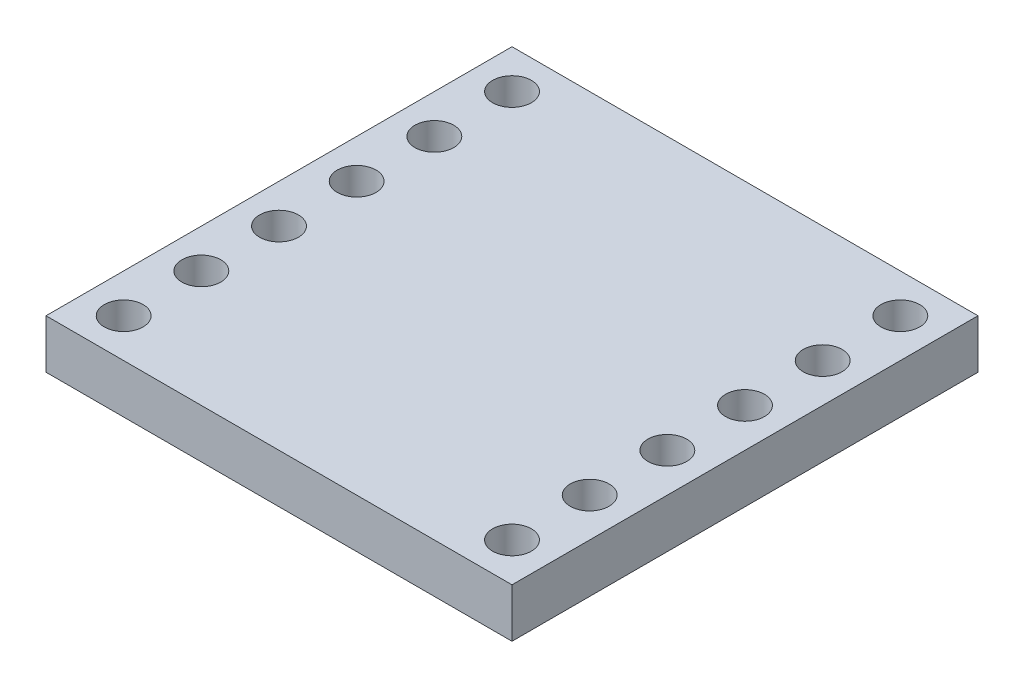
ISO-10303-21;
HEADER;
FILE_DESCRIPTION(('STEP AP214'),'2;1');
FILE_NAME('part.step','',(''),(''),'','','');
FILE_SCHEMA(('AUTOMOTIVE_DESIGN { 1 0 10303 214 1 1 1 1 }'));
ENDSEC;
DATA;
#1=APPLICATION_CONTEXT('core data for automotive mechanical design processes');
#2=APPLICATION_PROTOCOL_DEFINITION('international standard','automotive_design',2000,#1);
#3=PRODUCT_CONTEXT('',#1,'mechanical');
#4=PRODUCT('Part','Part','',(#3));
#5=PRODUCT_RELATED_PRODUCT_CATEGORY('part','',(#4));
#6=PRODUCT_DEFINITION_FORMATION('','',#4);
#7=PRODUCT_DEFINITION_CONTEXT('part definition',#1,'design');
#8=PRODUCT_DEFINITION('design','',#6,#7);
#9=PRODUCT_DEFINITION_SHAPE('','',#8);
#10=(LENGTH_UNIT() NAMED_UNIT(*) SI_UNIT(.MILLI.,.METRE.));
#11=(NAMED_UNIT(*) PLANE_ANGLE_UNIT() SI_UNIT($,.RADIAN.));
#12=(NAMED_UNIT(*) SI_UNIT($,.STERADIAN.) SOLID_ANGLE_UNIT());
#13=UNCERTAINTY_MEASURE_WITH_UNIT(LENGTH_MEASURE(1.E-05),#10,'distance_accuracy_value','');
#14=(GEOMETRIC_REPRESENTATION_CONTEXT(3) GLOBAL_UNCERTAINTY_ASSIGNED_CONTEXT((#13)) GLOBAL_UNIT_ASSIGNED_CONTEXT((#10,
#11,#12)) REPRESENTATION_CONTEXT('',''));
#15=CARTESIAN_POINT('',(0.,0.,0.));
#16=DIRECTION('',(0.,0.,1.));
#17=DIRECTION('',(1.,0.,0.));
#18=AXIS2_PLACEMENT_3D('',#15,#16,#17);
#19=CARTESIAN_POINT('',(0.,1.6,0.));
#20=DIRECTION('',(0.,-1.,0.));
#21=DIRECTION('',(0.,0.,-1.));
#22=AXIS2_PLACEMENT_3D('',#19,#20,#21);
#23=PLANE('',#22);
#24=DIRECTION('',(1.,0.,0.));
#25=VECTOR('',#24,1.);
#26=CARTESIAN_POINT('',(-7.62,1.6,7.62));
#27=LINE('',#26,#25);
#28=CARTESIAN_POINT('',(-7.62,1.6,7.62));
#29=VERTEX_POINT('',#28);
#30=CARTESIAN_POINT('',(7.62000000000001,1.6,7.61999999999999));
#31=VERTEX_POINT('',#30);
#32=EDGE_CURVE('E165',#29,#31,#27,.T.);
#33=ORIENTED_EDGE('',*,*,#32,.T.);
#34=DIRECTION('',(0.,0.,1.));
#35=VECTOR('',#34,1.);
#36=CARTESIAN_POINT('',(7.62,1.6,0.));
#37=LINE('',#36,#35);
#38=CARTESIAN_POINT('',(7.62,1.6,-7.62));
#39=VERTEX_POINT('',#38);
#40=EDGE_CURVE('E100',#39,#31,#37,.T.);
#41=ORIENTED_EDGE('',*,*,#40,.F.);
#42=DIRECTION('',(-1.,0.,0.));
#43=VECTOR('',#42,1.);
#44=CARTESIAN_POINT('',(0.,1.6,-7.62));
#45=LINE('',#44,#43);
#46=CARTESIAN_POINT('',(-7.62,1.6,-7.62));
#47=VERTEX_POINT('',#46);
#48=EDGE_CURVE('E76',#39,#47,#45,.T.);
#49=ORIENTED_EDGE('',*,*,#48,.T.);
#50=DIRECTION('',(0.,0.,1.));
#51=VECTOR('',#50,1.);
#52=CARTESIAN_POINT('',(-7.62,1.6,-7.62));
#53=LINE('',#52,#51);
#54=EDGE_CURVE('E57',#47,#29,#53,.T.);
#55=ORIENTED_EDGE('',*,*,#54,.T.);
#56=EDGE_LOOP('',(#33,#41,#49,#55));
#57=FACE_BOUND('',#56,.T.);
#58=CARTESIAN_POINT('',(-6.35,1.6,-6.35));
#59=DIRECTION('',(0.,1.,0.));
#60=DIRECTION('',(0.,0.,1.));
#61=AXIS2_PLACEMENT_3D('',#58,#59,#60);
#62=CIRCLE('',#61,0.635000000000001);
#63=CARTESIAN_POINT('',(-6.35,1.6,-5.715));
#64=VERTEX_POINT('',#63);
#65=EDGE_CURVE('E158',#64,#64,#62,.T.);
#66=ORIENTED_EDGE('',*,*,#65,.F.);
#67=EDGE_LOOP('',(#66));
#68=FACE_BOUND('',#67,.T.);
#69=CARTESIAN_POINT('',(-6.35,1.6,-3.81));
#70=DIRECTION('',(0.,1.,0.));
#71=DIRECTION('',(0.,0.,1.));
#72=AXIS2_PLACEMENT_3D('',#69,#70,#71);
#73=CIRCLE('',#72,0.635);
#74=CARTESIAN_POINT('',(-6.35,1.6,-3.175));
#75=VERTEX_POINT('',#74);
#76=EDGE_CURVE('E150',#75,#75,#73,.T.);
#77=ORIENTED_EDGE('',*,*,#76,.F.);
#78=EDGE_LOOP('',(#77));
#79=FACE_BOUND('',#78,.T.);
#80=CARTESIAN_POINT('',(-6.35,1.6,-1.27));
#81=DIRECTION('',(0.,1.,0.));
#82=DIRECTION('',(0.,0.,1.));
#83=AXIS2_PLACEMENT_3D('',#80,#81,#82);
#84=CIRCLE('',#83,0.635000000000001);
#85=CARTESIAN_POINT('',(-6.35,1.6,-0.634999999999999));
#86=VERTEX_POINT('',#85);
#87=EDGE_CURVE('E142',#86,#86,#84,.T.);
#88=ORIENTED_EDGE('',*,*,#87,.F.);
#89=EDGE_LOOP('',(#88));
#90=FACE_BOUND('',#89,.T.);
#91=CARTESIAN_POINT('',(-6.35,1.6,1.27));
#92=DIRECTION('',(0.,1.,0.));
#93=DIRECTION('',(0.,0.,1.));
#94=AXIS2_PLACEMENT_3D('',#91,#92,#93);
#95=CIRCLE('',#94,0.635000000000001);
#96=CARTESIAN_POINT('',(-6.35,1.6,1.905));
#97=VERTEX_POINT('',#96);
#98=EDGE_CURVE('E134',#97,#97,#95,.T.);
#99=ORIENTED_EDGE('',*,*,#98,.F.);
#100=EDGE_LOOP('',(#99));
#101=FACE_BOUND('',#100,.T.);
#102=CARTESIAN_POINT('',(-6.35,1.6,3.81));
#103=DIRECTION('',(0.,1.,0.));
#104=DIRECTION('',(0.,0.,1.));
#105=AXIS2_PLACEMENT_3D('',#102,#103,#104);
#106=CIRCLE('',#105,0.635);
#107=CARTESIAN_POINT('',(-6.35,1.6,4.445));
#108=VERTEX_POINT('',#107);
#109=EDGE_CURVE('E126',#108,#108,#106,.T.);
#110=ORIENTED_EDGE('',*,*,#109,.F.);
#111=EDGE_LOOP('',(#110));
#112=FACE_BOUND('',#111,.T.);
#113=CARTESIAN_POINT('',(-6.35,1.6,6.35));
#114=DIRECTION('',(0.,1.,0.));
#115=DIRECTION('',(0.,0.,1.));
#116=AXIS2_PLACEMENT_3D('',#113,#114,#115);
#117=CIRCLE('',#116,0.635);
#118=CARTESIAN_POINT('',(-6.35,1.6,6.985));
#119=VERTEX_POINT('',#118);
#120=EDGE_CURVE('E118',#119,#119,#117,.T.);
#121=ORIENTED_EDGE('',*,*,#120,.F.);
#122=EDGE_LOOP('',(#121));
#123=FACE_BOUND('',#122,.T.);
#124=CARTESIAN_POINT('',(6.35,1.6,6.35));
#125=DIRECTION('',(0.,-1.,0.));
#126=DIRECTION('',(0.,0.,1.));
#127=AXIS2_PLACEMENT_3D('',#124,#125,#126);
#128=CIRCLE('',#127,0.635);
#129=CARTESIAN_POINT('',(6.35,1.6,6.985));
#130=VERTEX_POINT('',#129);
#131=EDGE_CURVE('E249',#130,#130,#128,.T.);
#132=ORIENTED_EDGE('',*,*,#131,.T.);
#133=EDGE_LOOP('',(#132));
#134=FACE_BOUND('',#133,.T.);
#135=CARTESIAN_POINT('',(6.35,1.6,3.81));
#136=DIRECTION('',(0.,-1.,0.));
#137=DIRECTION('',(0.,0.,1.));
#138=AXIS2_PLACEMENT_3D('',#135,#136,#137);
#139=CIRCLE('',#138,0.635);
#140=CARTESIAN_POINT('',(6.35,1.6,4.445));
#141=VERTEX_POINT('',#140);
#142=EDGE_CURVE('E260',#141,#141,#139,.T.);
#143=ORIENTED_EDGE('',*,*,#142,.T.);
#144=EDGE_LOOP('',(#143));
#145=FACE_BOUND('',#144,.T.);
#146=CARTESIAN_POINT('',(6.35,1.6,1.27));
#147=DIRECTION('',(0.,-1.,0.));
#148=DIRECTION('',(0.,0.,1.));
#149=AXIS2_PLACEMENT_3D('',#146,#147,#148);
#150=CIRCLE('',#149,0.635000000000001);
#151=CARTESIAN_POINT('',(6.35,1.6,1.905));
#152=VERTEX_POINT('',#151);
#153=EDGE_CURVE('E268',#152,#152,#150,.T.);
#154=ORIENTED_EDGE('',*,*,#153,.T.);
#155=EDGE_LOOP('',(#154));
#156=FACE_BOUND('',#155,.T.);
#157=CARTESIAN_POINT('',(6.35,1.6,-1.27));
#158=DIRECTION('',(0.,-1.,0.));
#159=DIRECTION('',(0.,0.,1.));
#160=AXIS2_PLACEMENT_3D('',#157,#158,#159);
#161=CIRCLE('',#160,0.635000000000001);
#162=CARTESIAN_POINT('',(6.35,1.6,-0.635000000000003));
#163=VERTEX_POINT('',#162);
#164=EDGE_CURVE('E276',#163,#163,#161,.T.);
#165=ORIENTED_EDGE('',*,*,#164,.T.);
#166=EDGE_LOOP('',(#165));
#167=FACE_BOUND('',#166,.T.);
#168=CARTESIAN_POINT('',(6.35,1.6,-3.81));
#169=DIRECTION('',(0.,-1.,0.));
#170=DIRECTION('',(0.,0.,1.));
#171=AXIS2_PLACEMENT_3D('',#168,#169,#170);
#172=CIRCLE('',#171,0.635);
#173=CARTESIAN_POINT('',(6.35,1.6,-3.175));
#174=VERTEX_POINT('',#173);
#175=EDGE_CURVE('E284',#174,#174,#172,.T.);
#176=ORIENTED_EDGE('',*,*,#175,.T.);
#177=EDGE_LOOP('',(#176));
#178=FACE_BOUND('',#177,.T.);
#179=CARTESIAN_POINT('',(6.35,1.6,-6.35));
#180=DIRECTION('',(0.,-1.,0.));
#181=DIRECTION('',(0.,0.,1.));
#182=AXIS2_PLACEMENT_3D('',#179,#180,#181);
#183=CIRCLE('',#182,0.635000000000001);
#184=CARTESIAN_POINT('',(6.35,1.6,-5.715));
#185=VERTEX_POINT('',#184);
#186=EDGE_CURVE('E105',#185,#185,#183,.T.);
#187=ORIENTED_EDGE('',*,*,#186,.T.);
#188=EDGE_LOOP('',(#187));
#189=FACE_BOUND('',#188,.T.);
#190=ADVANCED_FACE('F39',(#57,#68,#79,#90,#101,#112,#123,#134,#145,#156,#167,#178,#189),#23,.F.);
#191=CARTESIAN_POINT('',(0.,0.,0.));
#192=DIRECTION('',(0.,-1.,0.));
#193=DIRECTION('',(0.,0.,-1.));
#194=AXIS2_PLACEMENT_3D('',#191,#192,#193);
#195=PLANE('',#194);
#196=CARTESIAN_POINT('',(-6.35,0.,3.81));
#197=DIRECTION('',(0.,1.,0.));
#198=DIRECTION('',(0.,0.,1.));
#199=AXIS2_PLACEMENT_3D('',#196,#197,#198);
#200=CIRCLE('',#199,0.635);
#201=CARTESIAN_POINT('',(-6.35,0.,4.445));
#202=VERTEX_POINT('',#201);
#203=EDGE_CURVE('E122',#202,#202,#200,.T.);
#204=ORIENTED_EDGE('',*,*,#203,.T.);
#205=EDGE_LOOP('',(#204));
#206=FACE_BOUND('',#205,.T.);
#207=CARTESIAN_POINT('',(-6.35,0.,-1.27));
#208=DIRECTION('',(0.,1.,0.));
#209=DIRECTION('',(0.,0.,1.));
#210=AXIS2_PLACEMENT_3D('',#207,#208,#209);
#211=CIRCLE('',#210,0.635000000000001);
#212=CARTESIAN_POINT('',(-6.35,0.,-0.634999999999999));
#213=VERTEX_POINT('',#212);
#214=EDGE_CURVE('E138',#213,#213,#211,.T.);
#215=ORIENTED_EDGE('',*,*,#214,.T.);
#216=EDGE_LOOP('',(#215));
#217=FACE_BOUND('',#216,.T.);
#218=CARTESIAN_POINT('',(-6.35,0.,-6.35));
#219=DIRECTION('',(0.,1.,0.));
#220=DIRECTION('',(0.,0.,1.));
#221=AXIS2_PLACEMENT_3D('',#218,#219,#220);
#222=CIRCLE('',#221,0.635000000000001);
#223=CARTESIAN_POINT('',(-6.35,0.,-5.715));
#224=VERTEX_POINT('',#223);
#225=EDGE_CURVE('E154',#224,#224,#222,.T.);
#226=ORIENTED_EDGE('',*,*,#225,.T.);
#227=EDGE_LOOP('',(#226));
#228=FACE_BOUND('',#227,.T.);
#229=DIRECTION('',(1.,0.,0.));
#230=VECTOR('',#229,1.);
#231=CARTESIAN_POINT('',(-7.62,0.,7.62));
#232=LINE('',#231,#230);
#233=CARTESIAN_POINT('',(-7.62,0.,7.62));
#234=VERTEX_POINT('',#233);
#235=CARTESIAN_POINT('',(7.62000000000001,0.,7.61999999999999));
#236=VERTEX_POINT('',#235);
#237=EDGE_CURVE('E91',#234,#236,#232,.T.);
#238=ORIENTED_EDGE('',*,*,#237,.F.);
#239=DIRECTION('',(0.,0.,1.));
#240=VECTOR('',#239,1.);
#241=CARTESIAN_POINT('',(-7.62,0.,0.));
#242=LINE('',#241,#240);
#243=CARTESIAN_POINT('',(-7.62,0.,-7.62));
#244=VERTEX_POINT('',#243);
#245=EDGE_CURVE('E68',#244,#234,#242,.T.);
#246=ORIENTED_EDGE('',*,*,#245,.F.);
#247=DIRECTION('',(-1.,0.,0.));
#248=VECTOR('',#247,1.);
#249=CARTESIAN_POINT('',(0.,0.,-7.62));
#250=LINE('',#249,#248);
#251=CARTESIAN_POINT('',(7.62,0.,-7.62));
#252=VERTEX_POINT('',#251);
#253=EDGE_CURVE('E84',#252,#244,#250,.T.);
#254=ORIENTED_EDGE('',*,*,#253,.F.);
#255=DIRECTION('',(0.,0.,1.));
#256=VECTOR('',#255,1.);
#257=CARTESIAN_POINT('',(7.62,0.,-7.62));
#258=LINE('',#257,#256);
#259=EDGE_CURVE('E88',#252,#236,#258,.T.);
#260=ORIENTED_EDGE('',*,*,#259,.T.);
#261=EDGE_LOOP('',(#238,#246,#254,#260));
#262=FACE_BOUND('',#261,.T.);
#263=CARTESIAN_POINT('',(-6.35,0.,-3.81));
#264=DIRECTION('',(0.,1.,0.));
#265=DIRECTION('',(0.,0.,1.));
#266=AXIS2_PLACEMENT_3D('',#263,#264,#265);
#267=CIRCLE('',#266,0.635);
#268=CARTESIAN_POINT('',(-6.35,0.,-3.175));
#269=VERTEX_POINT('',#268);
#270=EDGE_CURVE('E146',#269,#269,#267,.T.);
#271=ORIENTED_EDGE('',*,*,#270,.T.);
#272=EDGE_LOOP('',(#271));
#273=FACE_BOUND('',#272,.T.);
#274=CARTESIAN_POINT('',(-6.35,0.,1.27));
#275=DIRECTION('',(0.,1.,0.));
#276=DIRECTION('',(0.,0.,1.));
#277=AXIS2_PLACEMENT_3D('',#274,#275,#276);
#278=CIRCLE('',#277,0.635000000000001);
#279=CARTESIAN_POINT('',(-6.35,0.,1.905));
#280=VERTEX_POINT('',#279);
#281=EDGE_CURVE('E130',#280,#280,#278,.T.);
#282=ORIENTED_EDGE('',*,*,#281,.T.);
#283=EDGE_LOOP('',(#282));
#284=FACE_BOUND('',#283,.T.);
#285=CARTESIAN_POINT('',(-6.35,0.,6.35));
#286=DIRECTION('',(0.,1.,0.));
#287=DIRECTION('',(0.,0.,1.));
#288=AXIS2_PLACEMENT_3D('',#285,#286,#287);
#289=CIRCLE('',#288,0.635);
#290=CARTESIAN_POINT('',(-6.35,0.,6.985));
#291=VERTEX_POINT('',#290);
#292=EDGE_CURVE('E117',#291,#291,#289,.T.);
#293=ORIENTED_EDGE('',*,*,#292,.T.);
#294=EDGE_LOOP('',(#293));
#295=FACE_BOUND('',#294,.T.);
#296=CARTESIAN_POINT('',(6.35,0.,6.35));
#297=DIRECTION('',(0.,-1.,0.));
#298=DIRECTION('',(0.,0.,1.));
#299=AXIS2_PLACEMENT_3D('',#296,#297,#298);
#300=CIRCLE('',#299,0.635);
#301=CARTESIAN_POINT('',(6.35,0.,6.985));
#302=VERTEX_POINT('',#301);
#303=EDGE_CURVE('E252',#302,#302,#300,.T.);
#304=ORIENTED_EDGE('',*,*,#303,.F.);
#305=EDGE_LOOP('',(#304));
#306=FACE_BOUND('',#305,.T.);
#307=CARTESIAN_POINT('',(6.35,0.,3.81));
#308=DIRECTION('',(0.,-1.,0.));
#309=DIRECTION('',(0.,0.,1.));
#310=AXIS2_PLACEMENT_3D('',#307,#308,#309);
#311=CIRCLE('',#310,0.635);
#312=CARTESIAN_POINT('',(6.35,0.,4.445));
#313=VERTEX_POINT('',#312);
#314=EDGE_CURVE('E257',#313,#313,#311,.T.);
#315=ORIENTED_EDGE('',*,*,#314,.F.);
#316=EDGE_LOOP('',(#315));
#317=FACE_BOUND('',#316,.T.);
#318=CARTESIAN_POINT('',(6.35,0.,1.27));
#319=DIRECTION('',(0.,-1.,0.));
#320=DIRECTION('',(0.,0.,1.));
#321=AXIS2_PLACEMENT_3D('',#318,#319,#320);
#322=CIRCLE('',#321,0.635000000000001);
#323=CARTESIAN_POINT('',(6.35,0.,1.905));
#324=VERTEX_POINT('',#323);
#325=EDGE_CURVE('E264',#324,#324,#322,.T.);
#326=ORIENTED_EDGE('',*,*,#325,.F.);
#327=EDGE_LOOP('',(#326));
#328=FACE_BOUND('',#327,.T.);
#329=CARTESIAN_POINT('',(6.35,0.,-1.27));
#330=DIRECTION('',(0.,-1.,0.));
#331=DIRECTION('',(0.,0.,1.));
#332=AXIS2_PLACEMENT_3D('',#329,#330,#331);
#333=CIRCLE('',#332,0.635000000000001);
#334=CARTESIAN_POINT('',(6.35,0.,-0.635000000000003));
#335=VERTEX_POINT('',#334);
#336=EDGE_CURVE('E272',#335,#335,#333,.T.);
#337=ORIENTED_EDGE('',*,*,#336,.F.);
#338=EDGE_LOOP('',(#337));
#339=FACE_BOUND('',#338,.T.);
#340=CARTESIAN_POINT('',(6.35,0.,-3.81));
#341=DIRECTION('',(0.,-1.,0.));
#342=DIRECTION('',(0.,0.,1.));
#343=AXIS2_PLACEMENT_3D('',#340,#341,#342);
#344=CIRCLE('',#343,0.635);
#345=CARTESIAN_POINT('',(6.35,0.,-3.175));
#346=VERTEX_POINT('',#345);
#347=EDGE_CURVE('E280',#346,#346,#344,.T.);
#348=ORIENTED_EDGE('',*,*,#347,.F.);
#349=EDGE_LOOP('',(#348));
#350=FACE_BOUND('',#349,.T.);
#351=CARTESIAN_POINT('',(6.35,0.,-6.35));
#352=DIRECTION('',(0.,-1.,0.));
#353=DIRECTION('',(0.,0.,1.));
#354=AXIS2_PLACEMENT_3D('',#351,#352,#353);
#355=CIRCLE('',#354,0.635000000000001);
#356=CARTESIAN_POINT('',(6.35,0.,-5.715));
#357=VERTEX_POINT('',#356);
#358=EDGE_CURVE('E111',#357,#357,#355,.T.);
#359=ORIENTED_EDGE('',*,*,#358,.F.);
#360=EDGE_LOOP('',(#359));
#361=FACE_BOUND('',#360,.T.);
#362=ADVANCED_FACE('F85',(#206,#217,#228,#262,#273,#284,#295,#306,#317,#328,#339,#350,#361),
#195,.T.);
#363=CARTESIAN_POINT('',(-7.62,1.6,7.62));
#364=DIRECTION('',(0.,0.,-1.));
#365=DIRECTION('',(-1.,0.,0.));
#366=AXIS2_PLACEMENT_3D('',#363,#364,#365);
#367=PLANE('',#366);
#368=ORIENTED_EDGE('',*,*,#237,.T.);
#369=DIRECTION('',(0.,-1.,0.));
#370=VECTOR('',#369,1.);
#371=CARTESIAN_POINT('',(7.62000000000001,1.6,7.61999999999999));
#372=LINE('',#371,#370);
#373=EDGE_CURVE('E99',#31,#236,#372,.T.);
#374=ORIENTED_EDGE('',*,*,#373,.F.);
#375=ORIENTED_EDGE('',*,*,#32,.F.);
#376=DIRECTION('',(0.,-1.,0.));
#377=VECTOR('',#376,1.);
#378=CARTESIAN_POINT('',(-7.62,1.6,7.62));
#379=LINE('',#378,#377);
#380=EDGE_CURVE('E49',#29,#234,#379,.T.);
#381=ORIENTED_EDGE('',*,*,#380,.T.);
#382=EDGE_LOOP('',(#368,#374,#375,#381));
#383=FACE_BOUND('',#382,.T.);
#384=ADVANCED_FACE('F41',(#383),#367,.F.);
#385=CARTESIAN_POINT('',(0.,1.6,-7.62));
#386=DIRECTION('',(0.,0.,1.));
#387=DIRECTION('',(1.,0.,0.));
#388=AXIS2_PLACEMENT_3D('',#385,#386,#387);
#389=PLANE('',#388);
#390=ORIENTED_EDGE('',*,*,#253,.T.);
#391=DIRECTION('',(0.,-1.,0.));
#392=VECTOR('',#391,1.);
#393=CARTESIAN_POINT('',(-7.62,1.6,-7.62));
#394=LINE('',#393,#392);
#395=EDGE_CURVE('E11',#47,#244,#394,.T.);
#396=ORIENTED_EDGE('',*,*,#395,.F.);
#397=ORIENTED_EDGE('',*,*,#48,.F.);
#398=DIRECTION('',(0.,-1.,0.));
#399=VECTOR('',#398,1.);
#400=CARTESIAN_POINT('',(7.62,1.6,-7.62));
#401=LINE('',#400,#399);
#402=EDGE_CURVE('E94',#39,#252,#401,.T.);
#403=ORIENTED_EDGE('',*,*,#402,.T.);
#404=EDGE_LOOP('',(#390,#396,#397,#403));
#405=FACE_BOUND('',#404,.T.);
#406=ADVANCED_FACE('F95',(#405),#389,.F.);
#407=CARTESIAN_POINT('',(-7.62,1.6,0.));
#408=DIRECTION('',(1.,0.,0.));
#409=DIRECTION('',(0.,0.,-1.));
#410=AXIS2_PLACEMENT_3D('',#407,#408,#409);
#411=PLANE('',#410);
#412=ORIENTED_EDGE('',*,*,#245,.T.);
#413=ORIENTED_EDGE('',*,*,#380,.F.);
#414=ORIENTED_EDGE('',*,*,#54,.F.);
#415=ORIENTED_EDGE('',*,*,#395,.T.);
#416=EDGE_LOOP('',(#412,#413,#414,#415));
#417=FACE_BOUND('',#416,.T.);
#418=ADVANCED_FACE('F180',(#417),#411,.F.);
#419=CARTESIAN_POINT('',(-6.35,1.6,-6.35));
#420=DIRECTION('',(0.,-1.,0.));
#421=DIRECTION('',(0.,0.,-1.));
#422=AXIS2_PLACEMENT_3D('',#419,#420,#421);
#423=CYLINDRICAL_SURFACE('',#422,0.635000000000001);
#424=ORIENTED_EDGE('',*,*,#65,.T.);
#425=EDGE_LOOP('',(#424));
#426=FACE_BOUND('',#425,.T.);
#427=ORIENTED_EDGE('',*,*,#225,.F.);
#428=EDGE_LOOP('',(#427));
#429=FACE_BOUND('',#428,.T.);
#430=ADVANCED_FACE('F182',(#426,#429),#423,.F.);
#431=CARTESIAN_POINT('',(-6.35,1.6,-3.81));
#432=DIRECTION('',(0.,-1.,0.));
#433=DIRECTION('',(0.,0.,-1.));
#434=AXIS2_PLACEMENT_3D('',#431,#432,#433);
#435=CYLINDRICAL_SURFACE('',#434,0.635);
#436=ORIENTED_EDGE('',*,*,#76,.T.);
#437=EDGE_LOOP('',(#436));
#438=FACE_BOUND('',#437,.T.);
#439=ORIENTED_EDGE('',*,*,#270,.F.);
#440=EDGE_LOOP('',(#439));
#441=FACE_BOUND('',#440,.T.);
#442=ADVANCED_FACE('F188',(#438,#441),#435,.F.);
#443=CARTESIAN_POINT('',(-6.35,1.6,-1.27));
#444=DIRECTION('',(0.,-1.,0.));
#445=DIRECTION('',(0.,0.,-1.));
#446=AXIS2_PLACEMENT_3D('',#443,#444,#445);
#447=CYLINDRICAL_SURFACE('',#446,0.635000000000001);
#448=ORIENTED_EDGE('',*,*,#87,.T.);
#449=EDGE_LOOP('',(#448));
#450=FACE_BOUND('',#449,.T.);
#451=ORIENTED_EDGE('',*,*,#214,.F.);
#452=EDGE_LOOP('',(#451));
#453=FACE_BOUND('',#452,.T.);
#454=ADVANCED_FACE('F202',(#450,#453),#447,.F.);
#455=CARTESIAN_POINT('',(-6.35,1.6,1.27));
#456=DIRECTION('',(0.,-1.,0.));
#457=DIRECTION('',(0.,0.,-1.));
#458=AXIS2_PLACEMENT_3D('',#455,#456,#457);
#459=CYLINDRICAL_SURFACE('',#458,0.635000000000001);
#460=ORIENTED_EDGE('',*,*,#98,.T.);
#461=EDGE_LOOP('',(#460));
#462=FACE_BOUND('',#461,.T.);
#463=ORIENTED_EDGE('',*,*,#281,.F.);
#464=EDGE_LOOP('',(#463));
#465=FACE_BOUND('',#464,.T.);
#466=ADVANCED_FACE('F206',(#462,#465),#459,.F.);
#467=CARTESIAN_POINT('',(-6.35,1.6,3.81));
#468=DIRECTION('',(0.,-1.,0.));
#469=DIRECTION('',(0.,0.,-1.));
#470=AXIS2_PLACEMENT_3D('',#467,#468,#469);
#471=CYLINDRICAL_SURFACE('',#470,0.635);
#472=ORIENTED_EDGE('',*,*,#109,.T.);
#473=EDGE_LOOP('',(#472));
#474=FACE_BOUND('',#473,.T.);
#475=ORIENTED_EDGE('',*,*,#203,.F.);
#476=EDGE_LOOP('',(#475));
#477=FACE_BOUND('',#476,.T.);
#478=ADVANCED_FACE('F210',(#474,#477),#471,.F.);
#479=CARTESIAN_POINT('',(-6.35,1.6,6.35));
#480=DIRECTION('',(0.,-1.,0.));
#481=DIRECTION('',(0.,0.,-1.));
#482=AXIS2_PLACEMENT_3D('',#479,#480,#481);
#483=CYLINDRICAL_SURFACE('',#482,0.635);
#484=ORIENTED_EDGE('',*,*,#120,.T.);
#485=EDGE_LOOP('',(#484));
#486=FACE_BOUND('',#485,.T.);
#487=ORIENTED_EDGE('',*,*,#292,.F.);
#488=EDGE_LOOP('',(#487));
#489=FACE_BOUND('',#488,.T.);
#490=ADVANCED_FACE('F214',(#486,#489),#483,.F.);
#491=CARTESIAN_POINT('',(7.62,1.6,-7.62));
#492=DIRECTION('',(1.,0.,0.));
#493=DIRECTION('',(0.,0.,-1.));
#494=AXIS2_PLACEMENT_3D('',#491,#492,#493);
#495=PLANE('',#494);
#496=ORIENTED_EDGE('',*,*,#259,.F.);
#497=ORIENTED_EDGE('',*,*,#402,.F.);
#498=ORIENTED_EDGE('',*,*,#40,.T.);
#499=ORIENTED_EDGE('',*,*,#373,.T.);
#500=EDGE_LOOP('',(#496,#497,#498,#499));
#501=FACE_BOUND('',#500,.T.);
#502=ADVANCED_FACE('F102',(#501),#495,.T.);
#503=CARTESIAN_POINT('',(6.35,1.6,-6.35));
#504=DIRECTION('',(0.,-1.,0.));
#505=DIRECTION('',(0.,0.,-1.));
#506=AXIS2_PLACEMENT_3D('',#503,#504,#505);
#507=CYLINDRICAL_SURFACE('',#506,0.635000000000001);
#508=ORIENTED_EDGE('',*,*,#186,.F.);
#509=EDGE_LOOP('',(#508));
#510=FACE_BOUND('',#509,.T.);
#511=ORIENTED_EDGE('',*,*,#358,.T.);
#512=EDGE_LOOP('',(#511));
#513=FACE_BOUND('',#512,.T.);
#514=ADVANCED_FACE('F221',(#510,#513),#507,.F.);
#515=CARTESIAN_POINT('',(6.35,1.6,-3.81));
#516=DIRECTION('',(0.,-1.,0.));
#517=DIRECTION('',(0.,0.,-1.));
#518=AXIS2_PLACEMENT_3D('',#515,#516,#517);
#519=CYLINDRICAL_SURFACE('',#518,0.635);
#520=ORIENTED_EDGE('',*,*,#175,.F.);
#521=EDGE_LOOP('',(#520));
#522=FACE_BOUND('',#521,.T.);
#523=ORIENTED_EDGE('',*,*,#347,.T.);
#524=EDGE_LOOP('',(#523));
#525=FACE_BOUND('',#524,.T.);
#526=ADVANCED_FACE('F224',(#522,#525),#519,.F.);
#527=CARTESIAN_POINT('',(6.35,1.6,-1.27));
#528=DIRECTION('',(0.,-1.,0.));
#529=DIRECTION('',(0.,0.,-1.));
#530=AXIS2_PLACEMENT_3D('',#527,#528,#529);
#531=CYLINDRICAL_SURFACE('',#530,0.635000000000001);
#532=ORIENTED_EDGE('',*,*,#164,.F.);
#533=EDGE_LOOP('',(#532));
#534=FACE_BOUND('',#533,.T.);
#535=ORIENTED_EDGE('',*,*,#336,.T.);
#536=EDGE_LOOP('',(#535));
#537=FACE_BOUND('',#536,.T.);
#538=ADVANCED_FACE('F228',(#534,#537),#531,.F.);
#539=CARTESIAN_POINT('',(6.35,1.6,1.27));
#540=DIRECTION('',(0.,-1.,0.));
#541=DIRECTION('',(0.,0.,-1.));
#542=AXIS2_PLACEMENT_3D('',#539,#540,#541);
#543=CYLINDRICAL_SURFACE('',#542,0.635000000000001);
#544=ORIENTED_EDGE('',*,*,#153,.F.);
#545=EDGE_LOOP('',(#544));
#546=FACE_BOUND('',#545,.T.);
#547=ORIENTED_EDGE('',*,*,#325,.T.);
#548=EDGE_LOOP('',(#547));
#549=FACE_BOUND('',#548,.T.);
#550=ADVANCED_FACE('F232',(#546,#549),#543,.F.);
#551=CARTESIAN_POINT('',(6.35,1.6,3.81));
#552=DIRECTION('',(0.,-1.,0.));
#553=DIRECTION('',(0.,0.,-1.));
#554=AXIS2_PLACEMENT_3D('',#551,#552,#553);
#555=CYLINDRICAL_SURFACE('',#554,0.635);
#556=ORIENTED_EDGE('',*,*,#142,.F.);
#557=EDGE_LOOP('',(#556));
#558=FACE_BOUND('',#557,.T.);
#559=ORIENTED_EDGE('',*,*,#314,.T.);
#560=EDGE_LOOP('',(#559));
#561=FACE_BOUND('',#560,.T.);
#562=ADVANCED_FACE('F236',(#558,#561),#555,.F.);
#563=CARTESIAN_POINT('',(6.35,1.6,6.35));
#564=DIRECTION('',(0.,-1.,0.));
#565=DIRECTION('',(0.,0.,-1.));
#566=AXIS2_PLACEMENT_3D('',#563,#564,#565);
#567=CYLINDRICAL_SURFACE('',#566,0.635);
#568=ORIENTED_EDGE('',*,*,#131,.F.);
#569=EDGE_LOOP('',(#568));
#570=FACE_BOUND('',#569,.T.);
#571=ORIENTED_EDGE('',*,*,#303,.T.);
#572=EDGE_LOOP('',(#571));
#573=FACE_BOUND('',#572,.T.);
#574=ADVANCED_FACE('F240',(#570,#573),#567,.F.);
#575=CLOSED_SHELL('',(#190,#362,#384,#406,#418,#430,#442,#454,#466,#478,#490,#502,#514,#526,
#538,#550,#562,#574));
#576=MANIFOLD_SOLID_BREP('B2',#575);
#577=ADVANCED_BREP_SHAPE_REPRESENTATION('',(#18,#576),#14);
#578=SHAPE_DEFINITION_REPRESENTATION(#9,#577);
ENDSEC;
END-ISO-10303-21;
